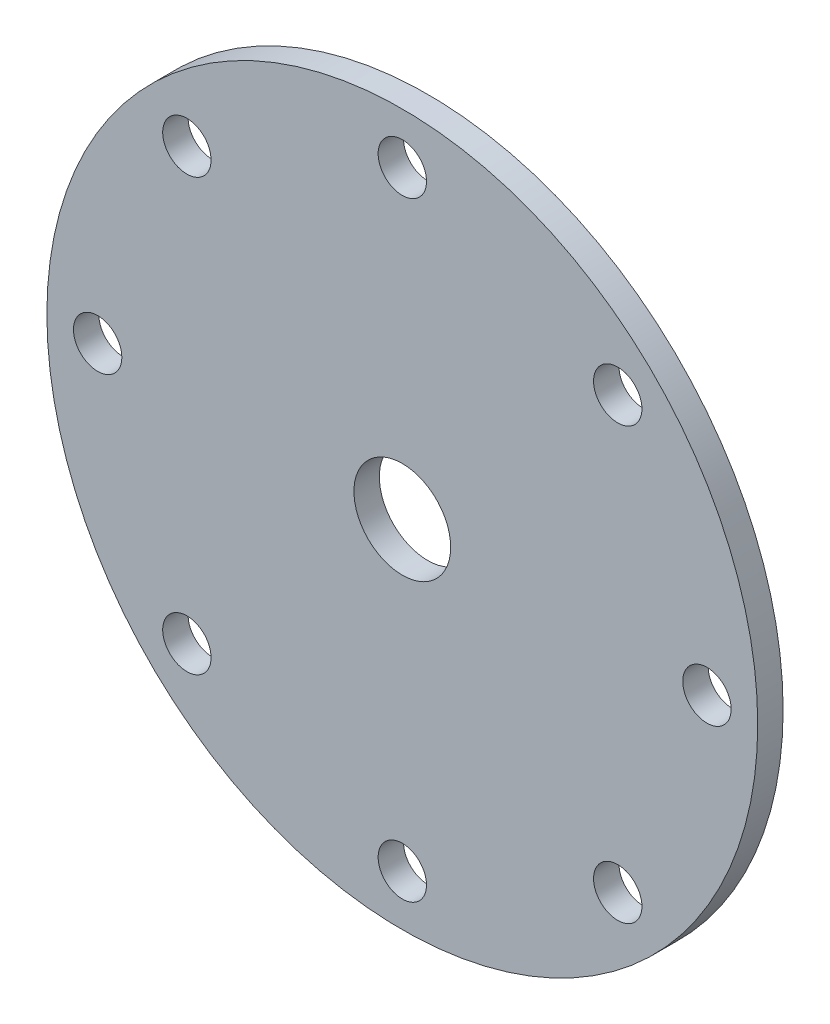
ISO-10303-21;
HEADER;
FILE_DESCRIPTION(('STEP AP214'),'2;1');
FILE_NAME('part.step','',(''),(''),'','','');
FILE_SCHEMA(('AUTOMOTIVE_DESIGN { 1 0 10303 214 1 1 1 1 }'));
ENDSEC;
DATA;
#1=APPLICATION_CONTEXT('core data for automotive mechanical design processes');
#2=APPLICATION_PROTOCOL_DEFINITION('international standard','automotive_design',2000,#1);
#3=PRODUCT_CONTEXT('',#1,'mechanical');
#4=PRODUCT('Part','Part','',(#3));
#5=PRODUCT_RELATED_PRODUCT_CATEGORY('part','',(#4));
#6=PRODUCT_DEFINITION_FORMATION('','',#4);
#7=PRODUCT_DEFINITION_CONTEXT('part definition',#1,'design');
#8=PRODUCT_DEFINITION('design','',#6,#7);
#9=PRODUCT_DEFINITION_SHAPE('','',#8);
#10=(LENGTH_UNIT() NAMED_UNIT(*) SI_UNIT(.MILLI.,.METRE.));
#11=(NAMED_UNIT(*) PLANE_ANGLE_UNIT() SI_UNIT($,.RADIAN.));
#12=(NAMED_UNIT(*) SI_UNIT($,.STERADIAN.) SOLID_ANGLE_UNIT());
#13=UNCERTAINTY_MEASURE_WITH_UNIT(LENGTH_MEASURE(1.E-05),#10,'distance_accuracy_value','');
#14=(GEOMETRIC_REPRESENTATION_CONTEXT(3) GLOBAL_UNCERTAINTY_ASSIGNED_CONTEXT((#13)) GLOBAL_UNIT_ASSIGNED_CONTEXT((#10,
#11,#12)) REPRESENTATION_CONTEXT('',''));
#15=CARTESIAN_POINT('',(0.,0.,0.));
#16=DIRECTION('',(0.,0.,1.));
#17=DIRECTION('',(1.,0.,0.));
#18=AXIS2_PLACEMENT_3D('',#15,#16,#17);
#19=CARTESIAN_POINT('',(0.,0.,5.));
#20=DIRECTION('',(0.,0.,-1.));
#21=DIRECTION('',(-1.,0.,0.));
#22=AXIS2_PLACEMENT_3D('',#19,#20,#21);
#23=CYLINDRICAL_SURFACE('',#22,9.525);
#24=CARTESIAN_POINT('',(0.,0.,5.));
#25=DIRECTION('',(0.,0.,1.));
#26=DIRECTION('',(1.,0.,0.));
#27=AXIS2_PLACEMENT_3D('',#24,#25,#26);
#28=CIRCLE('',#27,9.525);
#29=CARTESIAN_POINT('',(9.525,0.,5.));
#30=VERTEX_POINT('',#29);
#31=EDGE_CURVE('E42',#30,#30,#28,.T.);
#32=ORIENTED_EDGE('',*,*,#31,.T.);
#33=EDGE_LOOP('',(#32));
#34=FACE_BOUND('',#33,.T.);
#35=CARTESIAN_POINT('',(0.,0.,0.));
#36=DIRECTION('',(0.,0.,1.));
#37=DIRECTION('',(1.,0.,0.));
#38=AXIS2_PLACEMENT_3D('',#35,#36,#37);
#39=CIRCLE('',#38,9.525);
#40=CARTESIAN_POINT('',(9.525,0.,0.));
#41=VERTEX_POINT('',#40);
#42=EDGE_CURVE('E74',#41,#41,#39,.T.);
#43=ORIENTED_EDGE('',*,*,#42,.F.);
#44=EDGE_LOOP('',(#43));
#45=FACE_BOUND('',#44,.T.);
#46=ADVANCED_FACE('F34',(#34,#45),#23,.F.);
#47=CARTESIAN_POINT('',(0.,60.,5.));
#48=DIRECTION('',(0.,0.,-1.));
#49=DIRECTION('',(-1.,0.,0.));
#50=AXIS2_PLACEMENT_3D('',#47,#48,#49);
#51=CYLINDRICAL_SURFACE('',#50,4.7625);
#52=CARTESIAN_POINT('',(0.,60.,5.));
#53=DIRECTION('',(0.,0.,1.));
#54=DIRECTION('',(1.,0.,0.));
#55=AXIS2_PLACEMENT_3D('',#52,#53,#54);
#56=CIRCLE('',#55,4.7625);
#57=CARTESIAN_POINT('',(4.7625,60.,5.));
#58=VERTEX_POINT('',#57);
#59=EDGE_CURVE('E47',#58,#58,#56,.T.);
#60=ORIENTED_EDGE('',*,*,#59,.T.);
#61=EDGE_LOOP('',(#60));
#62=FACE_BOUND('',#61,.T.);
#63=CARTESIAN_POINT('',(0.,60.,0.));
#64=DIRECTION('',(0.,0.,1.));
#65=DIRECTION('',(1.,0.,0.));
#66=AXIS2_PLACEMENT_3D('',#63,#64,#65);
#67=CIRCLE('',#66,4.7625);
#68=CARTESIAN_POINT('',(4.7625,60.,0.));
#69=VERTEX_POINT('',#68);
#70=EDGE_CURVE('E72',#69,#69,#67,.T.);
#71=ORIENTED_EDGE('',*,*,#70,.F.);
#72=EDGE_LOOP('',(#71));
#73=FACE_BOUND('',#72,.T.);
#74=ADVANCED_FACE('F107',(#62,#73),#51,.F.);
#75=CARTESIAN_POINT('',(42.4264068711929,42.4264068711929,5.));
#76=DIRECTION('',(0.,0.,-1.));
#77=DIRECTION('',(-1.,0.,0.));
#78=AXIS2_PLACEMENT_3D('',#75,#76,#77);
#79=CYLINDRICAL_SURFACE('',#78,4.7625);
#80=CARTESIAN_POINT('',(42.4264068711929,42.4264068711929,5.));
#81=DIRECTION('',(0.,0.,1.));
#82=DIRECTION('',(1.,0.,0.));
#83=AXIS2_PLACEMENT_3D('',#80,#81,#82);
#84=CIRCLE('',#83,4.7625);
#85=CARTESIAN_POINT('',(47.1889068711929,42.4264068711929,5.));
#86=VERTEX_POINT('',#85);
#87=EDGE_CURVE('E102',#86,#86,#84,.T.);
#88=ORIENTED_EDGE('',*,*,#87,.T.);
#89=EDGE_LOOP('',(#88));
#90=FACE_BOUND('',#89,.T.);
#91=CARTESIAN_POINT('',(42.4264068711929,42.4264068711929,0.));
#92=DIRECTION('',(0.,0.,1.));
#93=DIRECTION('',(1.,0.,0.));
#94=AXIS2_PLACEMENT_3D('',#91,#92,#93);
#95=CIRCLE('',#94,4.7625);
#96=CARTESIAN_POINT('',(47.1889068711929,42.4264068711929,0.));
#97=VERTEX_POINT('',#96);
#98=EDGE_CURVE('E69',#97,#97,#95,.T.);
#99=ORIENTED_EDGE('',*,*,#98,.F.);
#100=EDGE_LOOP('',(#99));
#101=FACE_BOUND('',#100,.T.);
#102=ADVANCED_FACE('F125',(#90,#101),#79,.F.);
#103=CARTESIAN_POINT('',(60.,0.,5.));
#104=DIRECTION('',(0.,0.,-1.));
#105=DIRECTION('',(-1.,0.,0.));
#106=AXIS2_PLACEMENT_3D('',#103,#104,#105);
#107=CYLINDRICAL_SURFACE('',#106,4.7625);
#108=CARTESIAN_POINT('',(60.,0.,5.));
#109=DIRECTION('',(0.,0.,1.));
#110=DIRECTION('',(1.,0.,0.));
#111=AXIS2_PLACEMENT_3D('',#108,#109,#110);
#112=CIRCLE('',#111,4.7625);
#113=CARTESIAN_POINT('',(64.7625,0.,5.));
#114=VERTEX_POINT('',#113);
#115=EDGE_CURVE('E99',#114,#114,#112,.T.);
#116=ORIENTED_EDGE('',*,*,#115,.T.);
#117=EDGE_LOOP('',(#116));
#118=FACE_BOUND('',#117,.T.);
#119=CARTESIAN_POINT('',(60.,0.,0.));
#120=DIRECTION('',(0.,0.,1.));
#121=DIRECTION('',(1.,0.,0.));
#122=AXIS2_PLACEMENT_3D('',#119,#120,#121);
#123=CIRCLE('',#122,4.7625);
#124=CARTESIAN_POINT('',(64.7625,0.,0.));
#125=VERTEX_POINT('',#124);
#126=EDGE_CURVE('E66',#125,#125,#123,.T.);
#127=ORIENTED_EDGE('',*,*,#126,.F.);
#128=EDGE_LOOP('',(#127));
#129=FACE_BOUND('',#128,.T.);
#130=ADVANCED_FACE('F132',(#118,#129),#107,.F.);
#131=CARTESIAN_POINT('',(42.4264068711929,-42.4264068711928,5.));
#132=DIRECTION('',(0.,0.,-1.));
#133=DIRECTION('',(-1.,0.,0.));
#134=AXIS2_PLACEMENT_3D('',#131,#132,#133);
#135=CYLINDRICAL_SURFACE('',#134,4.7625);
#136=CARTESIAN_POINT('',(42.4264068711929,-42.4264068711928,5.));
#137=DIRECTION('',(0.,0.,1.));
#138=DIRECTION('',(1.,0.,0.));
#139=AXIS2_PLACEMENT_3D('',#136,#137,#138);
#140=CIRCLE('',#139,4.7625);
#141=CARTESIAN_POINT('',(47.1889068711929,-42.4264068711928,5.));
#142=VERTEX_POINT('',#141);
#143=EDGE_CURVE('E96',#142,#142,#140,.T.);
#144=ORIENTED_EDGE('',*,*,#143,.T.);
#145=EDGE_LOOP('',(#144));
#146=FACE_BOUND('',#145,.T.);
#147=CARTESIAN_POINT('',(42.4264068711929,-42.4264068711928,0.));
#148=DIRECTION('',(0.,0.,1.));
#149=DIRECTION('',(1.,0.,0.));
#150=AXIS2_PLACEMENT_3D('',#147,#148,#149);
#151=CIRCLE('',#150,4.7625);
#152=CARTESIAN_POINT('',(47.1889068711929,-42.4264068711928,0.));
#153=VERTEX_POINT('',#152);
#154=EDGE_CURVE('E63',#153,#153,#151,.T.);
#155=ORIENTED_EDGE('',*,*,#154,.F.);
#156=EDGE_LOOP('',(#155));
#157=FACE_BOUND('',#156,.T.);
#158=ADVANCED_FACE('F136',(#146,#157),#135,.F.);
#159=CARTESIAN_POINT('',(0.,-60.,5.));
#160=DIRECTION('',(0.,0.,-1.));
#161=DIRECTION('',(-1.,0.,0.));
#162=AXIS2_PLACEMENT_3D('',#159,#160,#161);
#163=CYLINDRICAL_SURFACE('',#162,4.7625);
#164=CARTESIAN_POINT('',(0.,-60.,5.));
#165=DIRECTION('',(0.,0.,1.));
#166=DIRECTION('',(1.,0.,0.));
#167=AXIS2_PLACEMENT_3D('',#164,#165,#166);
#168=CIRCLE('',#167,4.7625);
#169=CARTESIAN_POINT('',(4.76250000000002,-60.,5.));
#170=VERTEX_POINT('',#169);
#171=EDGE_CURVE('E93',#170,#170,#168,.T.);
#172=ORIENTED_EDGE('',*,*,#171,.T.);
#173=EDGE_LOOP('',(#172));
#174=FACE_BOUND('',#173,.T.);
#175=CARTESIAN_POINT('',(0.,-60.,0.));
#176=DIRECTION('',(0.,0.,1.));
#177=DIRECTION('',(1.,0.,0.));
#178=AXIS2_PLACEMENT_3D('',#175,#176,#177);
#179=CIRCLE('',#178,4.7625);
#180=CARTESIAN_POINT('',(4.76250000000002,-60.,0.));
#181=VERTEX_POINT('',#180);
#182=EDGE_CURVE('E60',#181,#181,#179,.T.);
#183=ORIENTED_EDGE('',*,*,#182,.F.);
#184=EDGE_LOOP('',(#183));
#185=FACE_BOUND('',#184,.T.);
#186=ADVANCED_FACE('F140',(#174,#185),#163,.F.);
#187=CARTESIAN_POINT('',(-42.4264068711928,-42.4264068711929,5.));
#188=DIRECTION('',(0.,0.,-1.));
#189=DIRECTION('',(-1.,0.,0.));
#190=AXIS2_PLACEMENT_3D('',#187,#188,#189);
#191=CYLINDRICAL_SURFACE('',#190,4.7625);
#192=CARTESIAN_POINT('',(-42.4264068711928,-42.4264068711929,5.));
#193=DIRECTION('',(0.,0.,1.));
#194=DIRECTION('',(1.,0.,0.));
#195=AXIS2_PLACEMENT_3D('',#192,#193,#194);
#196=CIRCLE('',#195,4.7625);
#197=CARTESIAN_POINT('',(-37.6639068711928,-42.4264068711929,5.));
#198=VERTEX_POINT('',#197);
#199=EDGE_CURVE('E88',#198,#198,#196,.T.);
#200=ORIENTED_EDGE('',*,*,#199,.T.);
#201=EDGE_LOOP('',(#200));
#202=FACE_BOUND('',#201,.T.);
#203=CARTESIAN_POINT('',(-42.4264068711928,-42.4264068711929,0.));
#204=DIRECTION('',(0.,0.,1.));
#205=DIRECTION('',(1.,0.,0.));
#206=AXIS2_PLACEMENT_3D('',#203,#204,#205);
#207=CIRCLE('',#206,4.7625);
#208=CARTESIAN_POINT('',(-37.6639068711928,-42.4264068711929,0.));
#209=VERTEX_POINT('',#208);
#210=EDGE_CURVE('E57',#209,#209,#207,.T.);
#211=ORIENTED_EDGE('',*,*,#210,.F.);
#212=EDGE_LOOP('',(#211));
#213=FACE_BOUND('',#212,.T.);
#214=ADVANCED_FACE('F144',(#202,#213),#191,.F.);
#215=CARTESIAN_POINT('',(-60.,0.,5.));
#216=DIRECTION('',(0.,0.,-1.));
#217=DIRECTION('',(-1.,0.,0.));
#218=AXIS2_PLACEMENT_3D('',#215,#216,#217);
#219=CYLINDRICAL_SURFACE('',#218,4.7625);
#220=CARTESIAN_POINT('',(-60.,0.,5.));
#221=DIRECTION('',(0.,0.,1.));
#222=DIRECTION('',(1.,0.,0.));
#223=AXIS2_PLACEMENT_3D('',#220,#221,#222);
#224=CIRCLE('',#223,4.7625);
#225=CARTESIAN_POINT('',(-55.2375,0.,5.));
#226=VERTEX_POINT('',#225);
#227=EDGE_CURVE('E83',#226,#226,#224,.T.);
#228=ORIENTED_EDGE('',*,*,#227,.T.);
#229=EDGE_LOOP('',(#228));
#230=FACE_BOUND('',#229,.T.);
#231=CARTESIAN_POINT('',(-60.,0.,0.));
#232=DIRECTION('',(0.,0.,1.));
#233=DIRECTION('',(1.,0.,0.));
#234=AXIS2_PLACEMENT_3D('',#231,#232,#233);
#235=CIRCLE('',#234,4.7625);
#236=CARTESIAN_POINT('',(-55.2375,0.,0.));
#237=VERTEX_POINT('',#236);
#238=EDGE_CURVE('E54',#237,#237,#235,.T.);
#239=ORIENTED_EDGE('',*,*,#238,.F.);
#240=EDGE_LOOP('',(#239));
#241=FACE_BOUND('',#240,.T.);
#242=ADVANCED_FACE('F147',(#230,#241),#219,.F.);
#243=CARTESIAN_POINT('',(-42.4264068711929,42.4264068711928,5.));
#244=DIRECTION('',(0.,0.,-1.));
#245=DIRECTION('',(-1.,0.,0.));
#246=AXIS2_PLACEMENT_3D('',#243,#244,#245);
#247=CYLINDRICAL_SURFACE('',#246,4.7625);
#248=CARTESIAN_POINT('',(-42.4264068711929,42.4264068711928,5.));
#249=DIRECTION('',(0.,0.,1.));
#250=DIRECTION('',(1.,0.,0.));
#251=AXIS2_PLACEMENT_3D('',#248,#249,#250);
#252=CIRCLE('',#251,4.7625);
#253=CARTESIAN_POINT('',(-37.6639068711929,42.4264068711928,5.));
#254=VERTEX_POINT('',#253);
#255=EDGE_CURVE('E79',#254,#254,#252,.T.);
#256=ORIENTED_EDGE('',*,*,#255,.T.);
#257=EDGE_LOOP('',(#256));
#258=FACE_BOUND('',#257,.T.);
#259=CARTESIAN_POINT('',(-42.4264068711929,42.4264068711928,0.));
#260=DIRECTION('',(0.,0.,1.));
#261=DIRECTION('',(1.,0.,0.));
#262=AXIS2_PLACEMENT_3D('',#259,#260,#261);
#263=CIRCLE('',#262,4.7625);
#264=CARTESIAN_POINT('',(-37.6639068711929,42.4264068711928,0.));
#265=VERTEX_POINT('',#264);
#266=EDGE_CURVE('E51',#265,#265,#263,.T.);
#267=ORIENTED_EDGE('',*,*,#266,.F.);
#268=EDGE_LOOP('',(#267));
#269=FACE_BOUND('',#268,.T.);
#270=ADVANCED_FACE('F36',(#258,#269),#247,.F.);
#271=CARTESIAN_POINT('',(0.,0.,5.));
#272=DIRECTION('',(0.,0.,-1.));
#273=DIRECTION('',(-1.,0.,0.));
#274=AXIS2_PLACEMENT_3D('',#271,#272,#273);
#275=CYLINDRICAL_SURFACE('',#274,70.);
#276=CARTESIAN_POINT('',(0.,0.,5.));
#277=DIRECTION('',(0.,0.,1.));
#278=DIRECTION('',(1.,0.,0.));
#279=AXIS2_PLACEMENT_3D('',#276,#277,#278);
#280=CIRCLE('',#279,70.);
#281=CARTESIAN_POINT('',(70.,0.,5.));
#282=VERTEX_POINT('',#281);
#283=EDGE_CURVE('E10',#282,#282,#280,.T.);
#284=ORIENTED_EDGE('',*,*,#283,.F.);
#285=EDGE_LOOP('',(#284));
#286=FACE_BOUND('',#285,.T.);
#287=CARTESIAN_POINT('',(0.,0.,0.));
#288=DIRECTION('',(0.,0.,1.));
#289=DIRECTION('',(1.,0.,0.));
#290=AXIS2_PLACEMENT_3D('',#287,#288,#289);
#291=CIRCLE('',#290,70.);
#292=CARTESIAN_POINT('',(70.,0.,0.));
#293=VERTEX_POINT('',#292);
#294=EDGE_CURVE('E38',#293,#293,#291,.T.);
#295=ORIENTED_EDGE('',*,*,#294,.T.);
#296=EDGE_LOOP('',(#295));
#297=FACE_BOUND('',#296,.T.);
#298=ADVANCED_FACE('F114',(#286,#297),#275,.T.);
#299=CARTESIAN_POINT('',(0.,0.,5.));
#300=DIRECTION('',(0.,0.,1.));
#301=DIRECTION('',(1.,0.,0.));
#302=AXIS2_PLACEMENT_3D('',#299,#300,#301);
#303=PLANE('',#302);
#304=ORIENTED_EDGE('',*,*,#255,.F.);
#305=EDGE_LOOP('',(#304));
#306=FACE_BOUND('',#305,.T.);
#307=ORIENTED_EDGE('',*,*,#227,.F.);
#308=EDGE_LOOP('',(#307));
#309=FACE_BOUND('',#308,.T.);
#310=ORIENTED_EDGE('',*,*,#199,.F.);
#311=EDGE_LOOP('',(#310));
#312=FACE_BOUND('',#311,.T.);
#313=ORIENTED_EDGE('',*,*,#171,.F.);
#314=EDGE_LOOP('',(#313));
#315=FACE_BOUND('',#314,.T.);
#316=ORIENTED_EDGE('',*,*,#143,.F.);
#317=EDGE_LOOP('',(#316));
#318=FACE_BOUND('',#317,.T.);
#319=ORIENTED_EDGE('',*,*,#115,.F.);
#320=EDGE_LOOP('',(#319));
#321=FACE_BOUND('',#320,.T.);
#322=ORIENTED_EDGE('',*,*,#87,.F.);
#323=EDGE_LOOP('',(#322));
#324=FACE_BOUND('',#323,.T.);
#325=ORIENTED_EDGE('',*,*,#59,.F.);
#326=EDGE_LOOP('',(#325));
#327=FACE_BOUND('',#326,.T.);
#328=ORIENTED_EDGE('',*,*,#31,.F.);
#329=EDGE_LOOP('',(#328));
#330=FACE_BOUND('',#329,.T.);
#331=ORIENTED_EDGE('',*,*,#283,.T.);
#332=EDGE_LOOP('',(#331));
#333=FACE_BOUND('',#332,.T.);
#334=ADVANCED_FACE('F110',(#306,#309,#312,#315,#318,#321,#324,#327,#330,#333),#303,.T.);
#335=CARTESIAN_POINT('',(0.,0.,0.));
#336=DIRECTION('',(0.,0.,1.));
#337=DIRECTION('',(1.,0.,0.));
#338=AXIS2_PLACEMENT_3D('',#335,#336,#337);
#339=PLANE('',#338);
#340=ORIENTED_EDGE('',*,*,#266,.T.);
#341=EDGE_LOOP('',(#340));
#342=FACE_BOUND('',#341,.T.);
#343=ORIENTED_EDGE('',*,*,#238,.T.);
#344=EDGE_LOOP('',(#343));
#345=FACE_BOUND('',#344,.T.);
#346=ORIENTED_EDGE('',*,*,#210,.T.);
#347=EDGE_LOOP('',(#346));
#348=FACE_BOUND('',#347,.T.);
#349=ORIENTED_EDGE('',*,*,#182,.T.);
#350=EDGE_LOOP('',(#349));
#351=FACE_BOUND('',#350,.T.);
#352=ORIENTED_EDGE('',*,*,#154,.T.);
#353=EDGE_LOOP('',(#352));
#354=FACE_BOUND('',#353,.T.);
#355=ORIENTED_EDGE('',*,*,#126,.T.);
#356=EDGE_LOOP('',(#355));
#357=FACE_BOUND('',#356,.T.);
#358=ORIENTED_EDGE('',*,*,#98,.T.);
#359=EDGE_LOOP('',(#358));
#360=FACE_BOUND('',#359,.T.);
#361=ORIENTED_EDGE('',*,*,#70,.T.);
#362=EDGE_LOOP('',(#361));
#363=FACE_BOUND('',#362,.T.);
#364=ORIENTED_EDGE('',*,*,#42,.T.);
#365=EDGE_LOOP('',(#364));
#366=FACE_BOUND('',#365,.T.);
#367=ORIENTED_EDGE('',*,*,#294,.F.);
#368=EDGE_LOOP('',(#367));
#369=FACE_BOUND('',#368,.T.);
#370=ADVANCED_FACE('F113',(#342,#345,#348,#351,#354,#357,#360,#363,#366,#369),#339,.F.);
#371=CLOSED_SHELL('',(#46,#74,#102,#130,#158,#186,#214,#242,#270,#298,#334,#370));
#372=MANIFOLD_SOLID_BREP('B2',#371);
#373=ADVANCED_BREP_SHAPE_REPRESENTATION('',(#18,#372),#14);
#374=SHAPE_DEFINITION_REPRESENTATION(#9,#373);
ENDSEC;
END-ISO-10303-21;
